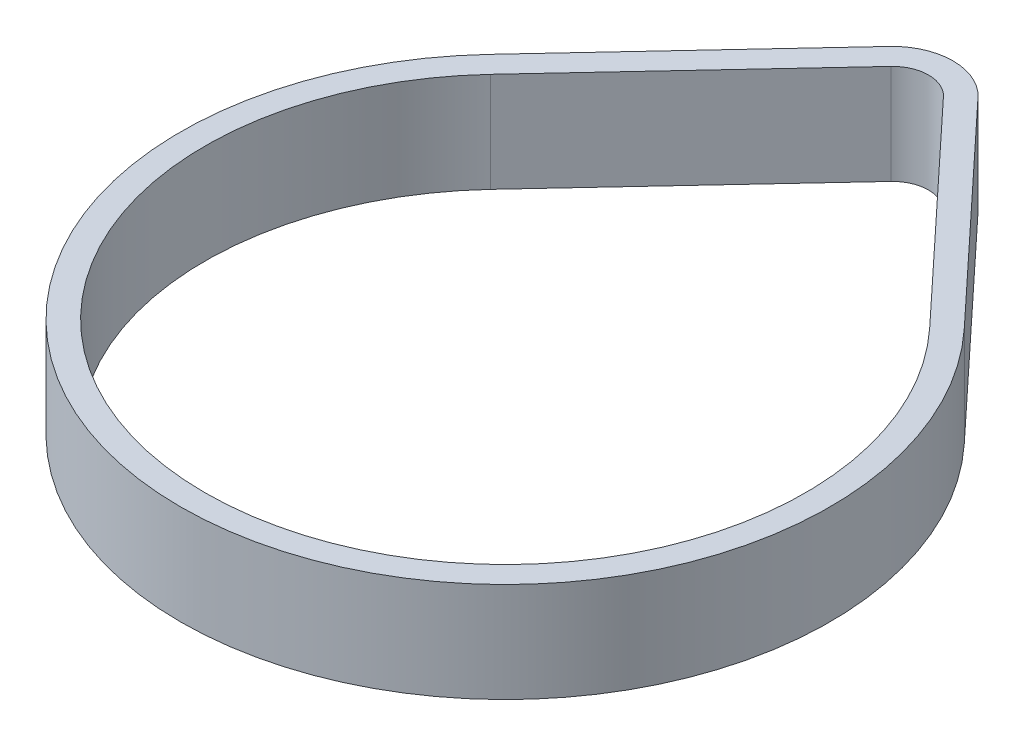
ISO-10303-21;
HEADER;
FILE_DESCRIPTION(('STEP AP214'),'2;1');
FILE_NAME('part.step','',(''),(''),'','','');
FILE_SCHEMA(('AUTOMOTIVE_DESIGN { 1 0 10303 214 1 1 1 1 }'));
ENDSEC;
DATA;
#1=APPLICATION_CONTEXT('core data for automotive mechanical design processes');
#2=APPLICATION_PROTOCOL_DEFINITION('international standard','automotive_design',2000,#1);
#3=PRODUCT_CONTEXT('',#1,'mechanical');
#4=PRODUCT('Part','Part','',(#3));
#5=PRODUCT_RELATED_PRODUCT_CATEGORY('part','',(#4));
#6=PRODUCT_DEFINITION_FORMATION('','',#4);
#7=PRODUCT_DEFINITION_CONTEXT('part definition',#1,'design');
#8=PRODUCT_DEFINITION('design','',#6,#7);
#9=PRODUCT_DEFINITION_SHAPE('','',#8);
#10=(LENGTH_UNIT() NAMED_UNIT(*) SI_UNIT(.MILLI.,.METRE.));
#11=(NAMED_UNIT(*) PLANE_ANGLE_UNIT() SI_UNIT($,.RADIAN.));
#12=(NAMED_UNIT(*) SI_UNIT($,.STERADIAN.) SOLID_ANGLE_UNIT());
#13=UNCERTAINTY_MEASURE_WITH_UNIT(LENGTH_MEASURE(1.E-05),#10,'distance_accuracy_value','');
#14=(GEOMETRIC_REPRESENTATION_CONTEXT(3) GLOBAL_UNCERTAINTY_ASSIGNED_CONTEXT((#13)) GLOBAL_UNIT_ASSIGNED_CONTEXT((#10,
#11,#12)) REPRESENTATION_CONTEXT('',''));
#15=CARTESIAN_POINT('',(0.,0.,0.));
#16=DIRECTION('',(0.,0.,1.));
#17=DIRECTION('',(1.,0.,0.));
#18=AXIS2_PLACEMENT_3D('',#15,#16,#17);
#19=CARTESIAN_POINT('',(3.95991909482378,7.5,-61.9987469807624));
#20=DIRECTION('',(-0.730916180367859,0.,0.682467242639864));
#21=DIRECTION('',(0.,1.,0.));
#22=AXIS2_PLACEMENT_3D('',#19,#20,#21);
#23=PLANE('',#22);
#24=DIRECTION('',(-0.682467242639864,0.,-0.730916180367859));
#25=VECTOR('',#24,1.);
#26=CARTESIAN_POINT('',(3.95991909482378,-7.5,-61.9987469807624));
#27=LINE('',#26,#25);
#28=CARTESIAN_POINT('',(33.0421497641391,-7.5,-30.8519436921978));
#29=VERTEX_POINT('',#28);
#30=CARTESIAN_POINT('',(3.95991909482379,-7.5,-61.9987469807624));
#31=VERTEX_POINT('',#30);
#32=EDGE_CURVE('E170',#29,#31,#27,.T.);
#33=ORIENTED_EDGE('',*,*,#32,.F.);
#34=DIRECTION('',(0.,-1.,0.));
#35=VECTOR('',#34,1.);
#36=CARTESIAN_POINT('',(33.0421497641391,7.5,-30.8519436921978));
#37=LINE('',#36,#35);
#38=CARTESIAN_POINT('',(33.0421497641391,7.5,-30.8519436921978));
#39=VERTEX_POINT('',#38);
#40=EDGE_CURVE('E11',#39,#29,#37,.T.);
#41=ORIENTED_EDGE('',*,*,#40,.F.);
#42=DIRECTION('',(-0.682467242639864,0.,-0.730916180367859));
#43=VECTOR('',#42,1.);
#44=CARTESIAN_POINT('',(3.95991909482378,7.5,-61.9987469807624));
#45=LINE('',#44,#43);
#46=CARTESIAN_POINT('',(3.95991909482378,7.5,-61.9987469807624));
#47=VERTEX_POINT('',#46);
#48=EDGE_CURVE('E126',#39,#47,#45,.T.);
#49=ORIENTED_EDGE('',*,*,#48,.T.);
#50=DIRECTION('',(0.,-1.,0.));
#51=VECTOR('',#50,1.);
#52=CARTESIAN_POINT('',(3.95991909482378,7.5,-61.9987469807624));
#53=LINE('',#52,#51);
#54=EDGE_CURVE('E106',#47,#31,#53,.T.);
#55=ORIENTED_EDGE('',*,*,#54,.T.);
#56=EDGE_LOOP('',(#33,#41,#49,#55));
#57=FACE_BOUND('',#56,.T.);
#58=ADVANCED_FACE('F16',(#57),#23,.T.);
#59=CARTESIAN_POINT('',(0.,7.5,0.));
#60=DIRECTION('',(0.,-1.,0.));
#61=DIRECTION('',(0.,0.,-1.));
#62=AXIS2_PLACEMENT_3D('',#59,#60,#61);
#63=CYLINDRICAL_SURFACE('',#62,45.2064828384418);
#64=CARTESIAN_POINT('',(0.,-7.5,0.));
#65=DIRECTION('',(0.,1.,0.));
#66=DIRECTION('',(1.,0.,0.));
#67=AXIS2_PLACEMENT_3D('',#64,#65,#66);
#68=CIRCLE('',#67,45.2064828384418);
#69=CARTESIAN_POINT('',(-33.0421497641391,-7.5,-30.8519436921978));
#70=VERTEX_POINT('',#69);
#71=EDGE_CURVE('E162',#70,#29,#68,.T.);
#72=ORIENTED_EDGE('',*,*,#71,.F.);
#73=DIRECTION('',(0.,-1.,0.));
#74=VECTOR('',#73,1.);
#75=CARTESIAN_POINT('',(-33.0421497641391,7.5,-30.8519436921978));
#76=LINE('',#75,#74);
#77=CARTESIAN_POINT('',(-33.0421497641391,7.5,-30.8519436921978));
#78=VERTEX_POINT('',#77);
#79=EDGE_CURVE('E25',#78,#70,#76,.T.);
#80=ORIENTED_EDGE('',*,*,#79,.F.);
#81=CARTESIAN_POINT('',(0.,7.5,0.));
#82=DIRECTION('',(0.,1.,0.));
#83=DIRECTION('',(1.,0.,0.));
#84=AXIS2_PLACEMENT_3D('',#81,#82,#83);
#85=CIRCLE('',#84,45.2064828384418);
#86=EDGE_CURVE('E124',#78,#39,#85,.T.);
#87=ORIENTED_EDGE('',*,*,#86,.T.);
#88=ORIENTED_EDGE('',*,*,#40,.T.);
#89=EDGE_LOOP('',(#72,#80,#87,#88));
#90=FACE_BOUND('',#89,.T.);
#91=ADVANCED_FACE('F175',(#90),#63,.F.);
#92=CARTESIAN_POINT('',(-3.95991909482379,7.5,-61.9987469807623));
#93=DIRECTION('',(0.730916180367859,0.,0.682467242639864));
#94=DIRECTION('',(0.,-1.,0.));
#95=AXIS2_PLACEMENT_3D('',#92,#93,#94);
#96=PLANE('',#95);
#97=DIRECTION('',(-0.682467242639864,0.,0.730916180367859));
#98=VECTOR('',#97,1.);
#99=CARTESIAN_POINT('',(-3.95991909482379,-7.5,-61.9987469807623));
#100=LINE('',#99,#98);
#101=CARTESIAN_POINT('',(-3.95991909482379,-7.5,-61.9987469807623));
#102=VERTEX_POINT('',#101);
#103=EDGE_CURVE('E119',#102,#70,#100,.T.);
#104=ORIENTED_EDGE('',*,*,#103,.F.);
#105=DIRECTION('',(0.,-1.,0.));
#106=VECTOR('',#105,1.);
#107=CARTESIAN_POINT('',(-3.95991909482379,7.5,-61.9987469807623));
#108=LINE('',#107,#106);
#109=CARTESIAN_POINT('',(-3.95991909482379,7.5,-61.9987469807623));
#110=VERTEX_POINT('',#109);
#111=EDGE_CURVE('E103',#110,#102,#108,.T.);
#112=ORIENTED_EDGE('',*,*,#111,.F.);
#113=DIRECTION('',(-0.682467242639864,0.,0.730916180367859));
#114=VECTOR('',#113,1.);
#115=CARTESIAN_POINT('',(-3.95991909482379,7.5,-61.9987469807623));
#116=LINE('',#115,#114);
#117=EDGE_CURVE('E116',#110,#78,#116,.T.);
#118=ORIENTED_EDGE('',*,*,#117,.T.);
#119=ORIENTED_EDGE('',*,*,#79,.T.);
#120=EDGE_LOOP('',(#104,#112,#118,#119));
#121=FACE_BOUND('',#120,.T.);
#122=ADVANCED_FACE('F113',(#121),#96,.T.);
#123=CARTESIAN_POINT('',(6.65188338711861,7.5,-64.512273835405));
#124=DIRECTION('',(-0.730916180367859,0.,0.682467242639864));
#125=DIRECTION('',(0.,1.,0.));
#126=AXIS2_PLACEMENT_3D('',#123,#124,#125);
#127=PLANE('',#126);
#128=DIRECTION('',(-0.682467242639864,0.,-0.730916180367859));
#129=VECTOR('',#128,1.);
#130=CARTESIAN_POINT('',(6.65188338711861,-7.5,-64.512273835405));
#131=LINE('',#130,#129);
#132=CARTESIAN_POINT('',(35.7341140564339,-7.5,-33.3654705468403));
#133=VERTEX_POINT('',#132);
#134=CARTESIAN_POINT('',(6.65188338711861,-7.5,-64.512273835405));
#135=VERTEX_POINT('',#134);
#136=EDGE_CURVE('E144',#133,#135,#131,.T.);
#137=ORIENTED_EDGE('',*,*,#136,.T.);
#138=DIRECTION('',(0.,-1.,0.));
#139=VECTOR('',#138,1.);
#140=CARTESIAN_POINT('',(6.65188338711861,7.5,-64.512273835405));
#141=LINE('',#140,#139);
#142=CARTESIAN_POINT('',(6.65188338711861,7.5,-64.512273835405));
#143=VERTEX_POINT('',#142);
#144=EDGE_CURVE('E160',#143,#135,#141,.T.);
#145=ORIENTED_EDGE('',*,*,#144,.F.);
#146=DIRECTION('',(-0.682467242639864,0.,-0.730916180367859));
#147=VECTOR('',#146,1.);
#148=CARTESIAN_POINT('',(6.65188338711861,7.5,-64.512273835405));
#149=LINE('',#148,#147);
#150=CARTESIAN_POINT('',(35.7341140564339,7.5,-33.3654705468403));
#151=VERTEX_POINT('',#150);
#152=EDGE_CURVE('E128',#151,#143,#149,.T.);
#153=ORIENTED_EDGE('',*,*,#152,.F.);
#154=DIRECTION('',(0.,-1.,0.));
#155=VECTOR('',#154,1.);
#156=CARTESIAN_POINT('',(35.7341140564339,7.5,-33.3654705468403));
#157=LINE('',#156,#155);
#158=EDGE_CURVE('E120',#151,#133,#157,.T.);
#159=ORIENTED_EDGE('',*,*,#158,.T.);
#160=EDGE_LOOP('',(#137,#145,#153,#159));
#161=FACE_BOUND('',#160,.T.);
#162=ADVANCED_FACE('F295',(#161),#127,.F.);
#163=CARTESIAN_POINT('',(0.,7.5,0.));
#164=DIRECTION('',(0.,-1.,0.));
#165=DIRECTION('',(0.,0.,-1.));
#166=AXIS2_PLACEMENT_3D('',#163,#164,#165);
#167=CYLINDRICAL_SURFACE('',#166,48.8894828384418);
#168=CARTESIAN_POINT('',(0.,-7.5,0.));
#169=DIRECTION('',(0.,1.,0.));
#170=DIRECTION('',(1.,0.,0.));
#171=AXIS2_PLACEMENT_3D('',#168,#169,#170);
#172=CIRCLE('',#171,48.8894828384418);
#173=CARTESIAN_POINT('',(-35.7341140564339,-7.5,-33.3654705468403));
#174=VERTEX_POINT('',#173);
#175=EDGE_CURVE('E146',#174,#133,#172,.T.);
#176=ORIENTED_EDGE('',*,*,#175,.T.);
#177=ORIENTED_EDGE('',*,*,#158,.F.);
#178=CARTESIAN_POINT('',(0.,7.5,0.));
#179=DIRECTION('',(0.,1.,0.));
#180=DIRECTION('',(1.,0.,0.));
#181=AXIS2_PLACEMENT_3D('',#178,#179,#180);
#182=CIRCLE('',#181,48.8894828384418);
#183=CARTESIAN_POINT('',(-35.7341140564339,7.5,-33.3654705468403));
#184=VERTEX_POINT('',#183);
#185=EDGE_CURVE('E140',#184,#151,#182,.T.);
#186=ORIENTED_EDGE('',*,*,#185,.F.);
#187=DIRECTION('',(0.,-1.,0.));
#188=VECTOR('',#187,1.);
#189=CARTESIAN_POINT('',(-35.7341140564339,7.5,-33.3654705468403));
#190=LINE('',#189,#188);
#191=EDGE_CURVE('E152',#184,#174,#190,.T.);
#192=ORIENTED_EDGE('',*,*,#191,.T.);
#193=EDGE_LOOP('',(#176,#177,#186,#192));
#194=FACE_BOUND('',#193,.T.);
#195=ADVANCED_FACE('F321',(#194),#167,.T.);
#196=CARTESIAN_POINT('',(-6.65188338711861,7.5,-64.512273835405));
#197=DIRECTION('',(0.730916180367859,0.,0.682467242639865));
#198=DIRECTION('',(0.,-1.,0.));
#199=AXIS2_PLACEMENT_3D('',#196,#197,#198);
#200=PLANE('',#199);
#201=DIRECTION('',(-0.682467242639865,0.,0.730916180367859));
#202=VECTOR('',#201,1.);
#203=CARTESIAN_POINT('',(-6.65188338711861,-7.5,-64.512273835405));
#204=LINE('',#203,#202);
#205=CARTESIAN_POINT('',(-6.65188338711861,-7.5,-64.512273835405));
#206=VERTEX_POINT('',#205);
#207=EDGE_CURVE('E153',#206,#174,#204,.T.);
#208=ORIENTED_EDGE('',*,*,#207,.T.);
#209=ORIENTED_EDGE('',*,*,#191,.F.);
#210=DIRECTION('',(-0.682467242639865,0.,0.730916180367859));
#211=VECTOR('',#210,1.);
#212=CARTESIAN_POINT('',(-6.65188338711861,7.5,-64.512273835405));
#213=LINE('',#212,#211);
#214=CARTESIAN_POINT('',(-6.65188338711861,7.5,-64.512273835405));
#215=VERTEX_POINT('',#214);
#216=EDGE_CURVE('E191',#215,#184,#213,.T.);
#217=ORIENTED_EDGE('',*,*,#216,.F.);
#218=DIRECTION('',(0.,-1.,0.));
#219=VECTOR('',#218,1.);
#220=CARTESIAN_POINT('',(-6.65188338711861,7.5,-64.512273835405));
#221=LINE('',#220,#219);
#222=EDGE_CURVE('E143',#215,#206,#221,.T.);
#223=ORIENTED_EDGE('',*,*,#222,.T.);
#224=EDGE_LOOP('',(#208,#209,#217,#223));
#225=FACE_BOUND('',#224,.T.);
#226=ADVANCED_FACE('F311',(#225),#200,.F.);
#227=CARTESIAN_POINT('',(0.,-7.5,-58.3013119830021));
#228=DIRECTION('',(0.,1.,0.));
#229=DIRECTION('',(1.,0.,0.));
#230=AXIS2_PLACEMENT_3D('',#227,#228,#229);
#231=PLANE('',#230);
#232=CARTESIAN_POINT('',(0.,-7.5,-58.3013119830021));
#233=DIRECTION('',(0.,1.,0.));
#234=DIRECTION('',(1.,0.,0.));
#235=AXIS2_PLACEMENT_3D('',#232,#233,#234);
#236=CIRCLE('',#235,5.4177472071159);
#237=EDGE_CURVE('E112',#31,#102,#236,.T.);
#238=ORIENTED_EDGE('',*,*,#237,.T.);
#239=ORIENTED_EDGE('',*,*,#103,.T.);
#240=ORIENTED_EDGE('',*,*,#71,.T.);
#241=ORIENTED_EDGE('',*,*,#32,.T.);
#242=EDGE_LOOP('',(#238,#239,#240,#241));
#243=FACE_BOUND('',#242,.T.);
#244=CARTESIAN_POINT('',(0.,-7.5,-58.3013119830021));
#245=DIRECTION('',(0.,1.,0.));
#246=DIRECTION('',(1.,0.,0.));
#247=AXIS2_PLACEMENT_3D('',#244,#245,#246);
#248=CIRCLE('',#247,9.1007472071159);
#249=EDGE_CURVE('E193',#135,#206,#248,.T.);
#250=ORIENTED_EDGE('',*,*,#249,.F.);
#251=ORIENTED_EDGE('',*,*,#136,.F.);
#252=ORIENTED_EDGE('',*,*,#175,.F.);
#253=ORIENTED_EDGE('',*,*,#207,.F.);
#254=EDGE_LOOP('',(#250,#251,#252,#253));
#255=FACE_BOUND('',#254,.T.);
#256=ADVANCED_FACE('F180',(#243,#255),#231,.F.);
#257=CARTESIAN_POINT('',(0.,7.5,-58.3013119830021));
#258=DIRECTION('',(0.,1.,0.));
#259=DIRECTION('',(1.,0.,0.));
#260=AXIS2_PLACEMENT_3D('',#257,#258,#259);
#261=PLANE('',#260);
#262=ORIENTED_EDGE('',*,*,#117,.F.);
#263=CARTESIAN_POINT('',(0.,7.5,-58.3013119830021));
#264=DIRECTION('',(0.,1.,0.));
#265=DIRECTION('',(1.,0.,0.));
#266=AXIS2_PLACEMENT_3D('',#263,#264,#265);
#267=CIRCLE('',#266,5.4177472071159);
#268=EDGE_CURVE('E97',#47,#110,#267,.T.);
#269=ORIENTED_EDGE('',*,*,#268,.F.);
#270=ORIENTED_EDGE('',*,*,#48,.F.);
#271=ORIENTED_EDGE('',*,*,#86,.F.);
#272=EDGE_LOOP('',(#262,#269,#270,#271));
#273=FACE_BOUND('',#272,.T.);
#274=ORIENTED_EDGE('',*,*,#152,.T.);
#275=CARTESIAN_POINT('',(0.,7.5,-58.3013119830021));
#276=DIRECTION('',(0.,1.,0.));
#277=DIRECTION('',(1.,0.,0.));
#278=AXIS2_PLACEMENT_3D('',#275,#276,#277);
#279=CIRCLE('',#278,9.1007472071159);
#280=EDGE_CURVE('E184',#143,#215,#279,.T.);
#281=ORIENTED_EDGE('',*,*,#280,.T.);
#282=ORIENTED_EDGE('',*,*,#216,.T.);
#283=ORIENTED_EDGE('',*,*,#185,.T.);
#284=EDGE_LOOP('',(#274,#281,#282,#283));
#285=FACE_BOUND('',#284,.T.);
#286=ADVANCED_FACE('F123',(#273,#285),#261,.T.);
#287=CARTESIAN_POINT('',(0.,7.5,-58.3013119830021));
#288=DIRECTION('',(0.,-1.,0.));
#289=DIRECTION('',(0.,0.,-1.));
#290=AXIS2_PLACEMENT_3D('',#287,#288,#289);
#291=CYLINDRICAL_SURFACE('',#290,9.1007472071159);
#292=ORIENTED_EDGE('',*,*,#280,.F.);
#293=ORIENTED_EDGE('',*,*,#144,.T.);
#294=ORIENTED_EDGE('',*,*,#249,.T.);
#295=ORIENTED_EDGE('',*,*,#222,.F.);
#296=EDGE_LOOP('',(#292,#293,#294,#295));
#297=FACE_BOUND('',#296,.T.);
#298=ADVANCED_FACE('F284',(#297),#291,.T.);
#299=CARTESIAN_POINT('',(0.,7.5,-58.3013119830021));
#300=DIRECTION('',(0.,-1.,0.));
#301=DIRECTION('',(0.,0.,-1.));
#302=AXIS2_PLACEMENT_3D('',#299,#300,#301);
#303=CYLINDRICAL_SURFACE('',#302,5.41774720711591);
#304=ORIENTED_EDGE('',*,*,#268,.T.);
#305=ORIENTED_EDGE('',*,*,#111,.T.);
#306=ORIENTED_EDGE('',*,*,#237,.F.);
#307=ORIENTED_EDGE('',*,*,#54,.F.);
#308=EDGE_LOOP('',(#304,#305,#306,#307));
#309=FACE_BOUND('',#308,.T.);
#310=ADVANCED_FACE('F101',(#309),#303,.F.);
#311=CLOSED_SHELL('',(#58,#91,#122,#162,#195,#226,#256,#286,#298,#310));
#312=MANIFOLD_SOLID_BREP('B1',#311);
#313=ADVANCED_BREP_SHAPE_REPRESENTATION('',(#18,#312),#14);
#314=SHAPE_DEFINITION_REPRESENTATION(#9,#313);
ENDSEC;
END-ISO-10303-21;
